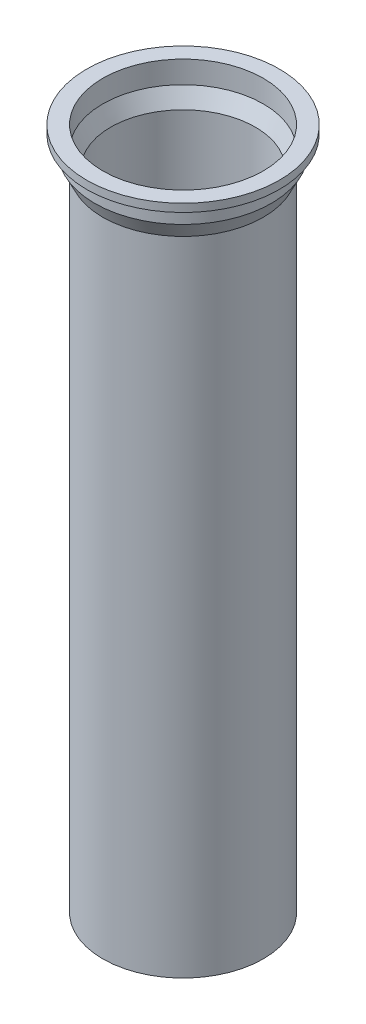
ISO-10303-21;
HEADER;
FILE_DESCRIPTION(('STEP AP214'),'2;1');
FILE_NAME('part.step','',(''),(''),'','','');
FILE_SCHEMA(('AUTOMOTIVE_DESIGN { 1 0 10303 214 1 1 1 1 }'));
ENDSEC;
DATA;
#1=APPLICATION_CONTEXT('core data for automotive mechanical design processes');
#2=APPLICATION_PROTOCOL_DEFINITION('international standard','automotive_design',2000,#1);
#3=PRODUCT_CONTEXT('',#1,'mechanical');
#4=PRODUCT('Part','Part','',(#3));
#5=PRODUCT_RELATED_PRODUCT_CATEGORY('part','',(#4));
#6=PRODUCT_DEFINITION_FORMATION('','',#4);
#7=PRODUCT_DEFINITION_CONTEXT('part definition',#1,'design');
#8=PRODUCT_DEFINITION('design','',#6,#7);
#9=PRODUCT_DEFINITION_SHAPE('','',#8);
#10=(LENGTH_UNIT() NAMED_UNIT(*) SI_UNIT(.MILLI.,.METRE.));
#11=(NAMED_UNIT(*) PLANE_ANGLE_UNIT() SI_UNIT($,.RADIAN.));
#12=(NAMED_UNIT(*) SI_UNIT($,.STERADIAN.) SOLID_ANGLE_UNIT());
#13=UNCERTAINTY_MEASURE_WITH_UNIT(LENGTH_MEASURE(1.E-05),#10,'distance_accuracy_value','');
#14=(GEOMETRIC_REPRESENTATION_CONTEXT(3) GLOBAL_UNCERTAINTY_ASSIGNED_CONTEXT((#13)) GLOBAL_UNIT_ASSIGNED_CONTEXT((#10,
#11,#12)) REPRESENTATION_CONTEXT('',''));
#15=CARTESIAN_POINT('',(0.,0.,0.));
#16=DIRECTION('',(0.,0.,1.));
#17=DIRECTION('',(1.,0.,0.));
#18=AXIS2_PLACEMENT_3D('',#15,#16,#17);
#19=CARTESIAN_POINT('',(-60.,-5.00000000000001,0.));
#20=DIRECTION('',(0.,-1.,0.));
#21=DIRECTION('',(0.,0.,-1.));
#22=AXIS2_PLACEMENT_3D('',#19,#20,#21);
#23=PLANE('',#22);
#24=CARTESIAN_POINT('',(0.,-5.00000000000001,0.));
#25=DIRECTION('',(0.,1.,0.));
#26=DIRECTION('',(0.,0.,1.));
#27=AXIS2_PLACEMENT_3D('',#24,#25,#26);
#28=CIRCLE('',#27,55.);
#29=CARTESIAN_POINT('',(0.,-5.00000000000001,55.));
#30=VERTEX_POINT('',#29);
#31=EDGE_CURVE('E84',#30,#30,#28,.T.);
#32=ORIENTED_EDGE('',*,*,#31,.T.);
#33=EDGE_LOOP('',(#32));
#34=FACE_BOUND('',#33,.T.);
#35=CARTESIAN_POINT('',(0.,-5.00000000000001,0.));
#36=DIRECTION('',(0.,1.,0.));
#37=DIRECTION('',(0.,0.,1.));
#38=AXIS2_PLACEMENT_3D('',#35,#36,#37);
#39=CIRCLE('',#38,60.);
#40=CARTESIAN_POINT('',(0.,-5.00000000000001,60.));
#41=VERTEX_POINT('',#40);
#42=EDGE_CURVE('E10',#41,#41,#39,.T.);
#43=ORIENTED_EDGE('',*,*,#42,.F.);
#44=EDGE_LOOP('',(#43));
#45=FACE_BOUND('',#44,.T.);
#46=ADVANCED_FACE('F41',(#34,#45),#23,.T.);
#47=CARTESIAN_POINT('',(0.,0.,0.));
#48=DIRECTION('',(0.,1.,0.));
#49=DIRECTION('',(0.,0.,1.));
#50=AXIS2_PLACEMENT_3D('',#47,#48,#49);
#51=CYLINDRICAL_SURFACE('',#50,60.);
#52=ORIENTED_EDGE('',*,*,#42,.T.);
#53=EDGE_LOOP('',(#52));
#54=FACE_BOUND('',#53,.T.);
#55=CARTESIAN_POINT('',(0.,0.,0.));
#56=DIRECTION('',(0.,1.,0.));
#57=DIRECTION('',(0.,0.,1.));
#58=AXIS2_PLACEMENT_3D('',#55,#56,#57);
#59=CIRCLE('',#58,60.);
#60=CARTESIAN_POINT('',(0.,0.,60.));
#61=VERTEX_POINT('',#60);
#62=EDGE_CURVE('E48',#61,#61,#59,.T.);
#63=ORIENTED_EDGE('',*,*,#62,.F.);
#64=EDGE_LOOP('',(#63));
#65=FACE_BOUND('',#64,.T.);
#66=ADVANCED_FACE('F103',(#54,#65),#51,.T.);
#67=CARTESIAN_POINT('',(-50.,0.,0.));
#68=DIRECTION('',(0.,1.,0.));
#69=DIRECTION('',(0.,0.,1.));
#70=AXIS2_PLACEMENT_3D('',#67,#68,#69);
#71=PLANE('',#70);
#72=ORIENTED_EDGE('',*,*,#62,.T.);
#73=EDGE_LOOP('',(#72));
#74=FACE_BOUND('',#73,.T.);
#75=CARTESIAN_POINT('',(0.,0.,0.));
#76=DIRECTION('',(0.,1.,0.));
#77=DIRECTION('',(0.,0.,1.));
#78=AXIS2_PLACEMENT_3D('',#75,#76,#77);
#79=CIRCLE('',#78,50.);
#80=CARTESIAN_POINT('',(0.,0.,50.));
#81=VERTEX_POINT('',#80);
#82=EDGE_CURVE('E53',#81,#81,#79,.T.);
#83=ORIENTED_EDGE('',*,*,#82,.F.);
#84=EDGE_LOOP('',(#83));
#85=FACE_BOUND('',#84,.T.);
#86=ADVANCED_FACE('F107',(#74,#85),#71,.T.);
#87=CARTESIAN_POINT('',(0.,0.,0.));
#88=DIRECTION('',(0.,1.,0.));
#89=DIRECTION('',(0.,0.,1.));
#90=AXIS2_PLACEMENT_3D('',#87,#88,#89);
#91=CYLINDRICAL_SURFACE('',#90,50.);
#92=ORIENTED_EDGE('',*,*,#82,.T.);
#93=EDGE_LOOP('',(#92));
#94=FACE_BOUND('',#93,.T.);
#95=CARTESIAN_POINT('',(0.,-13.8196601125011,0.));
#96=DIRECTION('',(0.,1.,0.));
#97=DIRECTION('',(0.,0.,1.));
#98=AXIS2_PLACEMENT_3D('',#95,#96,#97);
#99=CIRCLE('',#98,50.);
#100=CARTESIAN_POINT('',(0.,-13.8196601125011,50.));
#101=VERTEX_POINT('',#100);
#102=EDGE_CURVE('E58',#101,#101,#99,.T.);
#103=ORIENTED_EDGE('',*,*,#102,.F.);
#104=EDGE_LOOP('',(#103));
#105=FACE_BOUND('',#104,.T.);
#106=ADVANCED_FACE('F111',(#94,#105),#91,.F.);
#107=CARTESIAN_POINT('',(0.,-23.8196601125011,0.));
#108=DIRECTION('',(0.,1.,0.));
#109=DIRECTION('',(0.,0.,1.));
#110=AXIS2_PLACEMENT_3D('',#107,#108,#109);
#111=CONICAL_SURFACE('',#110,45.,0.463647609000806);
#112=ORIENTED_EDGE('',*,*,#102,.T.);
#113=EDGE_LOOP('',(#112));
#114=FACE_BOUND('',#113,.T.);
#115=CARTESIAN_POINT('',(0.,-23.8196601125011,0.));
#116=DIRECTION('',(0.,1.,0.));
#117=DIRECTION('',(0.,0.,1.));
#118=AXIS2_PLACEMENT_3D('',#115,#116,#117);
#119=CIRCLE('',#118,45.);
#120=CARTESIAN_POINT('',(0.,-23.8196601125011,45.));
#121=VERTEX_POINT('',#120);
#122=EDGE_CURVE('E64',#121,#121,#119,.T.);
#123=ORIENTED_EDGE('',*,*,#122,.F.);
#124=EDGE_LOOP('',(#123));
#125=FACE_BOUND('',#124,.T.);
#126=ADVANCED_FACE('F117',(#114,#125),#111,.F.);
#127=CARTESIAN_POINT('',(0.,0.,0.));
#128=DIRECTION('',(0.,1.,0.));
#129=DIRECTION('',(0.,0.,1.));
#130=AXIS2_PLACEMENT_3D('',#127,#128,#129);
#131=CYLINDRICAL_SURFACE('',#130,45.);
#132=ORIENTED_EDGE('',*,*,#122,.T.);
#133=EDGE_LOOP('',(#132));
#134=FACE_BOUND('',#133,.T.);
#135=CARTESIAN_POINT('',(0.,-425.,0.));
#136=DIRECTION('',(0.,1.,0.));
#137=DIRECTION('',(0.,0.,1.));
#138=AXIS2_PLACEMENT_3D('',#135,#136,#137);
#139=CIRCLE('',#138,45.);
#140=CARTESIAN_POINT('',(0.,-425.,45.));
#141=VERTEX_POINT('',#140);
#142=EDGE_CURVE('E68',#141,#141,#139,.T.);
#143=ORIENTED_EDGE('',*,*,#142,.F.);
#144=EDGE_LOOP('',(#143));
#145=FACE_BOUND('',#144,.T.);
#146=ADVANCED_FACE('F121',(#134,#145),#131,.F.);
#147=CARTESIAN_POINT('',(-49.9999999999999,-425.,0.));
#148=DIRECTION('',(0.,-1.,0.));
#149=DIRECTION('',(0.,0.,-1.));
#150=AXIS2_PLACEMENT_3D('',#147,#148,#149);
#151=PLANE('',#150);
#152=ORIENTED_EDGE('',*,*,#142,.T.);
#153=EDGE_LOOP('',(#152));
#154=FACE_BOUND('',#153,.T.);
#155=CARTESIAN_POINT('',(0.,-425.,0.));
#156=DIRECTION('',(0.,1.,0.));
#157=DIRECTION('',(0.,0.,1.));
#158=AXIS2_PLACEMENT_3D('',#155,#156,#157);
#159=CIRCLE('',#158,49.9999999999999);
#160=CARTESIAN_POINT('',(0.,-425.,49.9999999999999));
#161=VERTEX_POINT('',#160);
#162=EDGE_CURVE('E72',#161,#161,#159,.T.);
#163=ORIENTED_EDGE('',*,*,#162,.F.);
#164=EDGE_LOOP('',(#163));
#165=FACE_BOUND('',#164,.T.);
#166=ADVANCED_FACE('F125',(#154,#165),#151,.T.);
#167=CARTESIAN_POINT('',(0.,0.,0.));
#168=DIRECTION('',(0.,1.,0.));
#169=DIRECTION('',(0.,0.,1.));
#170=AXIS2_PLACEMENT_3D('',#167,#168,#169);
#171=CYLINDRICAL_SURFACE('',#170,50.);
#172=ORIENTED_EDGE('',*,*,#162,.T.);
#173=EDGE_LOOP('',(#172));
#174=FACE_BOUND('',#173,.T.);
#175=CARTESIAN_POINT('',(0.,-25.,0.));
#176=DIRECTION('',(0.,1.,0.));
#177=DIRECTION('',(0.,0.,1.));
#178=AXIS2_PLACEMENT_3D('',#175,#176,#177);
#179=CIRCLE('',#178,50.);
#180=CARTESIAN_POINT('',(0.,-25.,50.));
#181=VERTEX_POINT('',#180);
#182=EDGE_CURVE('E76',#181,#181,#179,.T.);
#183=ORIENTED_EDGE('',*,*,#182,.F.);
#184=EDGE_LOOP('',(#183));
#185=FACE_BOUND('',#184,.T.);
#186=ADVANCED_FACE('F99',(#174,#185),#171,.T.);
#187=CARTESIAN_POINT('',(0.,-15.,0.));
#188=DIRECTION('',(0.,1.,0.));
#189=DIRECTION('',(0.,0.,1.));
#190=AXIS2_PLACEMENT_3D('',#187,#188,#189);
#191=CONICAL_SURFACE('',#190,55.,0.463647609000806);
#192=ORIENTED_EDGE('',*,*,#182,.T.);
#193=EDGE_LOOP('',(#192));
#194=FACE_BOUND('',#193,.T.);
#195=CARTESIAN_POINT('',(0.,-15.,0.));
#196=DIRECTION('',(0.,1.,0.));
#197=DIRECTION('',(0.,0.,1.));
#198=AXIS2_PLACEMENT_3D('',#195,#196,#197);
#199=CIRCLE('',#198,55.);
#200=CARTESIAN_POINT('',(0.,-15.,55.));
#201=VERTEX_POINT('',#200);
#202=EDGE_CURVE('E80',#201,#201,#199,.T.);
#203=ORIENTED_EDGE('',*,*,#202,.F.);
#204=EDGE_LOOP('',(#203));
#205=FACE_BOUND('',#204,.T.);
#206=ADVANCED_FACE('F93',(#194,#205),#191,.T.);
#207=CARTESIAN_POINT('',(0.,0.,0.));
#208=DIRECTION('',(0.,1.,0.));
#209=DIRECTION('',(0.,0.,1.));
#210=AXIS2_PLACEMENT_3D('',#207,#208,#209);
#211=CYLINDRICAL_SURFACE('',#210,55.);
#212=ORIENTED_EDGE('',*,*,#202,.T.);
#213=EDGE_LOOP('',(#212));
#214=FACE_BOUND('',#213,.T.);
#215=ORIENTED_EDGE('',*,*,#31,.F.);
#216=EDGE_LOOP('',(#215));
#217=FACE_BOUND('',#216,.T.);
#218=ADVANCED_FACE('F91',(#214,#217),#211,.T.);
#219=CLOSED_SHELL('',(#46,#66,#86,#106,#126,#146,#166,#186,#206,#218));
#220=MANIFOLD_SOLID_BREP('B2',#219);
#221=ADVANCED_BREP_SHAPE_REPRESENTATION('',(#18,#220),#14);
#222=SHAPE_DEFINITION_REPRESENTATION(#9,#221);
ENDSEC;
END-ISO-10303-21;
